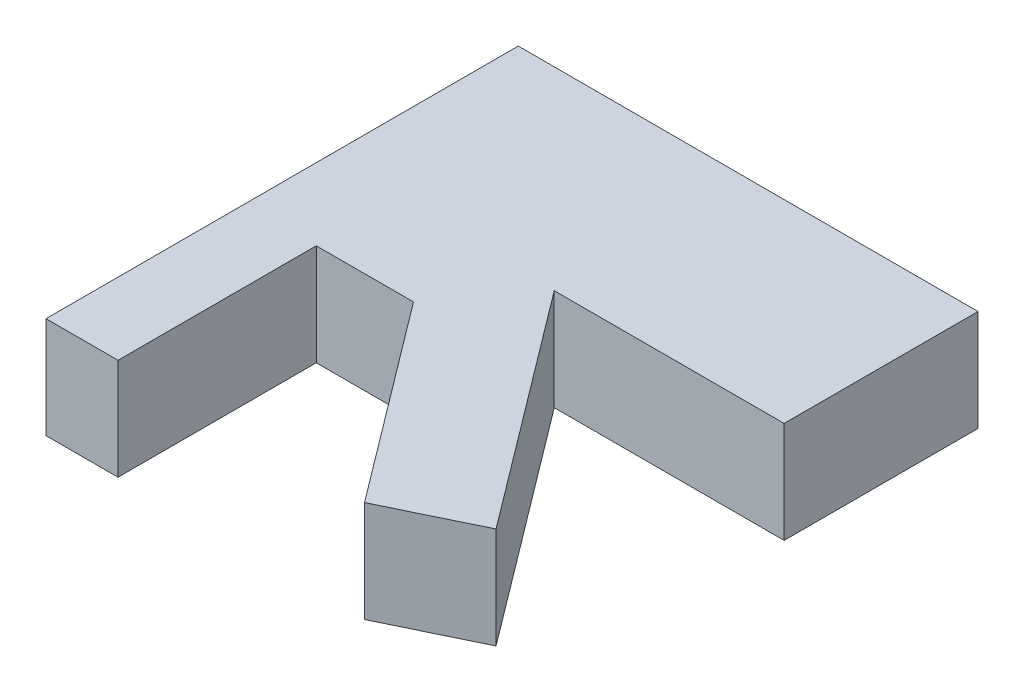
ISO-10303-21;
HEADER;
FILE_DESCRIPTION(('STEP AP214'),'2;1');
FILE_NAME('part.step','',(''),(''),'','','');
FILE_SCHEMA(('AUTOMOTIVE_DESIGN { 1 0 10303 214 1 1 1 1 }'));
ENDSEC;
DATA;
#1=APPLICATION_CONTEXT('core data for automotive mechanical design processes');
#2=APPLICATION_PROTOCOL_DEFINITION('international standard','automotive_design',2000,#1);
#3=PRODUCT_CONTEXT('',#1,'mechanical');
#4=PRODUCT('Part','Part','',(#3));
#5=PRODUCT_RELATED_PRODUCT_CATEGORY('part','',(#4));
#6=PRODUCT_DEFINITION_FORMATION('','',#4);
#7=PRODUCT_DEFINITION_CONTEXT('part definition',#1,'design');
#8=PRODUCT_DEFINITION('design','',#6,#7);
#9=PRODUCT_DEFINITION_SHAPE('','',#8);
#10=(LENGTH_UNIT() NAMED_UNIT(*) SI_UNIT(.MILLI.,.METRE.));
#11=(NAMED_UNIT(*) PLANE_ANGLE_UNIT() SI_UNIT($,.RADIAN.));
#12=(NAMED_UNIT(*) SI_UNIT($,.STERADIAN.) SOLID_ANGLE_UNIT());
#13=UNCERTAINTY_MEASURE_WITH_UNIT(LENGTH_MEASURE(1.E-05),#10,'distance_accuracy_value','');
#14=(GEOMETRIC_REPRESENTATION_CONTEXT(3) GLOBAL_UNCERTAINTY_ASSIGNED_CONTEXT((#13)) GLOBAL_UNIT_ASSIGNED_CONTEXT((#10,
#11,#12)) REPRESENTATION_CONTEXT('',''));
#15=CARTESIAN_POINT('',(0.,0.,0.));
#16=DIRECTION('',(0.,0.,1.));
#17=DIRECTION('',(1.,0.,0.));
#18=AXIS2_PLACEMENT_3D('',#15,#16,#17);
#19=CARTESIAN_POINT('',(7.10739238900271,10.,0.));
#20=DIRECTION('',(0.,0.,-1.));
#21=DIRECTION('',(-1.,0.,0.));
#22=AXIS2_PLACEMENT_3D('',#19,#20,#21);
#23=PLANE('',#22);
#24=DIRECTION('',(1.,0.,0.));
#25=VECTOR('',#24,1.);
#26=CARTESIAN_POINT('',(7.10739238900271,0.,0.));
#27=LINE('',#26,#25);
#28=CARTESIAN_POINT('',(0.,0.,0.));
#29=VERTEX_POINT('',#28);
#30=CARTESIAN_POINT('',(7.10739238900271,0.,0.));
#31=VERTEX_POINT('',#30);
#32=EDGE_CURVE('E141',#29,#31,#27,.T.);
#33=ORIENTED_EDGE('',*,*,#32,.T.);
#34=DIRECTION('',(0.,-1.,0.));
#35=VECTOR('',#34,1.);
#36=CARTESIAN_POINT('',(7.10739238900271,10.,0.));
#37=LINE('',#36,#35);
#38=CARTESIAN_POINT('',(7.10739238900271,10.,0.));
#39=VERTEX_POINT('',#38);
#40=EDGE_CURVE('E11',#39,#31,#37,.T.);
#41=ORIENTED_EDGE('',*,*,#40,.F.);
#42=DIRECTION('',(1.,0.,0.));
#43=VECTOR('',#42,1.);
#44=CARTESIAN_POINT('',(7.10739238900271,10.,0.));
#45=LINE('',#44,#43);
#46=CARTESIAN_POINT('',(0.,10.,0.));
#47=VERTEX_POINT('',#46);
#48=EDGE_CURVE('E159',#47,#39,#45,.T.);
#49=ORIENTED_EDGE('',*,*,#48,.F.);
#50=DIRECTION('',(0.,-1.,0.));
#51=VECTOR('',#50,1.);
#52=CARTESIAN_POINT('',(0.,10.,0.));
#53=LINE('',#52,#51);
#54=EDGE_CURVE('E137',#47,#29,#53,.T.);
#55=ORIENTED_EDGE('',*,*,#54,.T.);
#56=EDGE_LOOP('',(#33,#41,#49,#55));
#57=FACE_BOUND('',#56,.T.);
#58=ADVANCED_FACE('F33',(#57),#23,.F.);
#59=CARTESIAN_POINT('',(7.10739238900271,10.,-19.5669642323911));
#60=DIRECTION('',(-1.,0.,0.));
#61=DIRECTION('',(0.,0.,1.));
#62=AXIS2_PLACEMENT_3D('',#59,#60,#61);
#63=PLANE('',#62);
#64=DIRECTION('',(0.,0.,-1.));
#65=VECTOR('',#64,1.);
#66=CARTESIAN_POINT('',(7.10739238900271,0.,-19.5669642323911));
#67=LINE('',#66,#65);
#68=CARTESIAN_POINT('',(7.10739238900271,0.,-19.5669642323911));
#69=VERTEX_POINT('',#68);
#70=EDGE_CURVE('E144',#31,#69,#67,.T.);
#71=ORIENTED_EDGE('',*,*,#70,.T.);
#72=DIRECTION('',(0.,-1.,0.));
#73=VECTOR('',#72,1.);
#74=CARTESIAN_POINT('',(7.10739238900271,10.,-19.5669642323911));
#75=LINE('',#74,#73);
#76=CARTESIAN_POINT('',(7.10739238900271,10.,-19.5669642323911));
#77=VERTEX_POINT('',#76);
#78=EDGE_CURVE('E41',#77,#69,#75,.T.);
#79=ORIENTED_EDGE('',*,*,#78,.F.);
#80=DIRECTION('',(0.,0.,-1.));
#81=VECTOR('',#80,1.);
#82=CARTESIAN_POINT('',(7.10739238900271,10.,-19.5669642323911));
#83=LINE('',#82,#81);
#84=EDGE_CURVE('E98',#39,#77,#83,.T.);
#85=ORIENTED_EDGE('',*,*,#84,.F.);
#86=ORIENTED_EDGE('',*,*,#40,.T.);
#87=EDGE_LOOP('',(#71,#79,#85,#86));
#88=FACE_BOUND('',#87,.T.);
#89=ADVANCED_FACE('F208',(#88),#63,.F.);
#90=CARTESIAN_POINT('',(16.7037701899561,10.,-19.5669642323911));
#91=DIRECTION('',(0.,0.,-1.));
#92=DIRECTION('',(-1.,0.,0.));
#93=AXIS2_PLACEMENT_3D('',#90,#91,#92);
#94=PLANE('',#93);
#95=DIRECTION('',(1.,0.,0.));
#96=VECTOR('',#95,1.);
#97=CARTESIAN_POINT('',(16.7037701899561,0.,-19.5669642323911));
#98=LINE('',#97,#96);
#99=CARTESIAN_POINT('',(16.7037701899561,0.,-19.5669642323911));
#100=VERTEX_POINT('',#99);
#101=EDGE_CURVE('E146',#69,#100,#98,.T.);
#102=ORIENTED_EDGE('',*,*,#101,.T.);
#103=DIRECTION('',(0.,-1.,0.));
#104=VECTOR('',#103,1.);
#105=CARTESIAN_POINT('',(16.7037701899561,10.,-19.5669642323911));
#106=LINE('',#105,#104);
#107=CARTESIAN_POINT('',(16.7037701899561,10.,-19.5669642323911));
#108=VERTEX_POINT('',#107);
#109=EDGE_CURVE('E172',#108,#100,#106,.T.);
#110=ORIENTED_EDGE('',*,*,#109,.F.);
#111=DIRECTION('',(1.,0.,0.));
#112=VECTOR('',#111,1.);
#113=CARTESIAN_POINT('',(16.7037701899561,10.,-19.5669642323911));
#114=LINE('',#113,#112);
#115=EDGE_CURVE('E180',#77,#108,#114,.T.);
#116=ORIENTED_EDGE('',*,*,#115,.F.);
#117=ORIENTED_EDGE('',*,*,#78,.T.);
#118=EDGE_LOOP('',(#102,#110,#116,#117));
#119=FACE_BOUND('',#118,.T.);
#120=ADVANCED_FACE('F178',(#119),#94,.F.);
#121=CARTESIAN_POINT('',(31.4365432590505,10.,0.));
#122=DIRECTION('',(0.798870769139608,0.,-0.601502696763939));
#123=DIRECTION('',(-0.601502696763939,0.,-0.798870769139608));
#124=AXIS2_PLACEMENT_3D('',#121,#122,#123);
#125=PLANE('',#124);
#126=DIRECTION('',(0.601502696763939,0.,0.798870769139608));
#127=VECTOR('',#126,1.);
#128=CARTESIAN_POINT('',(31.4365432590505,0.,0.));
#129=LINE('',#128,#127);
#130=CARTESIAN_POINT('',(31.4365432590505,0.,0.));
#131=VERTEX_POINT('',#130);
#132=EDGE_CURVE('E148',#100,#131,#129,.T.);
#133=ORIENTED_EDGE('',*,*,#132,.T.);
#134=DIRECTION('',(0.,-1.,0.));
#135=VECTOR('',#134,1.);
#136=CARTESIAN_POINT('',(31.4365432590505,10.,0.));
#137=LINE('',#136,#135);
#138=CARTESIAN_POINT('',(31.4365432590505,10.,0.));
#139=VERTEX_POINT('',#138);
#140=EDGE_CURVE('E169',#139,#131,#137,.T.);
#141=ORIENTED_EDGE('',*,*,#140,.F.);
#142=DIRECTION('',(0.601502696763939,0.,0.798870769139608));
#143=VECTOR('',#142,1.);
#144=CARTESIAN_POINT('',(31.4365432590505,10.,0.));
#145=LINE('',#144,#143);
#146=EDGE_CURVE('E198',#108,#139,#145,.T.);
#147=ORIENTED_EDGE('',*,*,#146,.F.);
#148=ORIENTED_EDGE('',*,*,#109,.T.);
#149=EDGE_LOOP('',(#133,#141,#147,#148));
#150=FACE_BOUND('',#149,.T.);
#151=ADVANCED_FACE('F189',(#150),#125,.F.);
#152=CARTESIAN_POINT('',(40.1841031224384,10.,-4.23709930882854));
#153=DIRECTION('',(-0.435928453727026,0.,-0.899981323823536));
#154=DIRECTION('',(-0.899981323823536,0.,0.435928453727026));
#155=AXIS2_PLACEMENT_3D('',#152,#153,#154);
#156=PLANE('',#155);
#157=DIRECTION('',(0.899981323823536,0.,-0.435928453727026));
#158=VECTOR('',#157,1.);
#159=CARTESIAN_POINT('',(40.1841031224384,0.,-4.23709930882854));
#160=LINE('',#159,#158);
#161=CARTESIAN_POINT('',(40.1841031224384,0.,-4.23709930882854));
#162=VERTEX_POINT('',#161);
#163=EDGE_CURVE('E150',#131,#162,#160,.T.);
#164=ORIENTED_EDGE('',*,*,#163,.T.);
#165=DIRECTION('',(0.,-1.,0.));
#166=VECTOR('',#165,1.);
#167=CARTESIAN_POINT('',(40.1841031224384,10.,-4.23709930882854));
#168=LINE('',#167,#166);
#169=CARTESIAN_POINT('',(40.1841031224384,10.,-4.23709930882854));
#170=VERTEX_POINT('',#169);
#171=EDGE_CURVE('E166',#170,#162,#168,.T.);
#172=ORIENTED_EDGE('',*,*,#171,.F.);
#173=DIRECTION('',(0.899981323823536,0.,-0.435928453727026));
#174=VECTOR('',#173,1.);
#175=CARTESIAN_POINT('',(40.1841031224384,10.,-4.23709930882854));
#176=LINE('',#175,#174);
#177=EDGE_CURVE('E195',#139,#170,#176,.T.);
#178=ORIENTED_EDGE('',*,*,#177,.F.);
#179=ORIENTED_EDGE('',*,*,#140,.T.);
#180=EDGE_LOOP('',(#164,#172,#178,#179));
#181=FACE_BOUND('',#180,.T.);
#182=ADVANCED_FACE('F193',(#181),#156,.F.);
#183=CARTESIAN_POINT('',(22.6889833956625,10.,-27.4728051959528));
#184=DIRECTION('',(-0.798870769139608,0.,0.601502696763939));
#185=DIRECTION('',(0.601502696763939,0.,0.798870769139608));
#186=AXIS2_PLACEMENT_3D('',#183,#184,#185);
#187=PLANE('',#186);
#188=DIRECTION('',(-0.601502696763939,0.,-0.798870769139608));
#189=VECTOR('',#188,1.);
#190=CARTESIAN_POINT('',(22.6889833956625,0.,-27.4728051959528));
#191=LINE('',#190,#189);
#192=CARTESIAN_POINT('',(22.6889833956625,0.,-27.4728051959528));
#193=VERTEX_POINT('',#192);
#194=EDGE_CURVE('E152',#162,#193,#191,.T.);
#195=ORIENTED_EDGE('',*,*,#194,.T.);
#196=DIRECTION('',(0.,-1.,0.));
#197=VECTOR('',#196,1.);
#198=CARTESIAN_POINT('',(22.6889833956625,10.,-27.4728051959528));
#199=LINE('',#198,#197);
#200=CARTESIAN_POINT('',(22.6889833956625,10.,-27.4728051959528));
#201=VERTEX_POINT('',#200);
#202=EDGE_CURVE('E163',#201,#193,#199,.T.);
#203=ORIENTED_EDGE('',*,*,#202,.F.);
#204=DIRECTION('',(-0.601502696763939,0.,-0.798870769139608));
#205=VECTOR('',#204,1.);
#206=CARTESIAN_POINT('',(22.6889833956625,10.,-27.4728051959528));
#207=LINE('',#206,#205);
#208=EDGE_CURVE('E197',#170,#201,#207,.T.);
#209=ORIENTED_EDGE('',*,*,#208,.F.);
#210=ORIENTED_EDGE('',*,*,#171,.T.);
#211=EDGE_LOOP('',(#195,#203,#209,#210));
#212=FACE_BOUND('',#211,.T.);
#213=ADVANCED_FACE('F220',(#212),#187,.F.);
#214=CARTESIAN_POINT('',(45.3779667913251,10.,-27.4728051959528));
#215=DIRECTION('',(0.,0.,-1.));
#216=DIRECTION('',(-1.,0.,0.));
#217=AXIS2_PLACEMENT_3D('',#214,#215,#216);
#218=PLANE('',#217);
#219=DIRECTION('',(1.,0.,0.));
#220=VECTOR('',#219,1.);
#221=CARTESIAN_POINT('',(45.3779667913251,0.,-27.4728051959528));
#222=LINE('',#221,#220);
#223=CARTESIAN_POINT('',(45.3779667913251,0.,-27.4728051959528));
#224=VERTEX_POINT('',#223);
#225=EDGE_CURVE('E154',#193,#224,#222,.T.);
#226=ORIENTED_EDGE('',*,*,#225,.T.);
#227=DIRECTION('',(0.,-1.,0.));
#228=VECTOR('',#227,1.);
#229=CARTESIAN_POINT('',(45.3779667913251,10.,-27.4728051959528));
#230=LINE('',#229,#228);
#231=CARTESIAN_POINT('',(45.3779667913251,10.,-27.4728051959528));
#232=VERTEX_POINT('',#231);
#233=EDGE_CURVE('E132',#232,#224,#230,.T.);
#234=ORIENTED_EDGE('',*,*,#233,.F.);
#235=DIRECTION('',(1.,0.,0.));
#236=VECTOR('',#235,1.);
#237=CARTESIAN_POINT('',(45.3779667913251,10.,-27.4728051959528));
#238=LINE('',#237,#236);
#239=EDGE_CURVE('E123',#201,#232,#238,.T.);
#240=ORIENTED_EDGE('',*,*,#239,.F.);
#241=ORIENTED_EDGE('',*,*,#202,.T.);
#242=EDGE_LOOP('',(#226,#234,#240,#241));
#243=FACE_BOUND('',#242,.T.);
#244=ADVANCED_FACE('F223',(#243),#218,.F.);
#245=CARTESIAN_POINT('',(45.3779667913251,10.,-46.608092397114));
#246=DIRECTION('',(-1.,0.,0.));
#247=DIRECTION('',(0.,0.,1.));
#248=AXIS2_PLACEMENT_3D('',#245,#246,#247);
#249=PLANE('',#248);
#250=DIRECTION('',(0.,0.,-1.));
#251=VECTOR('',#250,1.);
#252=CARTESIAN_POINT('',(45.3779667913251,0.,-46.608092397114));
#253=LINE('',#252,#251);
#254=CARTESIAN_POINT('',(45.3779667913251,0.,-46.608092397114));
#255=VERTEX_POINT('',#254);
#256=EDGE_CURVE('E131',#224,#255,#253,.T.);
#257=ORIENTED_EDGE('',*,*,#256,.T.);
#258=DIRECTION('',(0.,-1.,0.));
#259=VECTOR('',#258,1.);
#260=CARTESIAN_POINT('',(45.3779667913251,10.,-46.608092397114));
#261=LINE('',#260,#259);
#262=CARTESIAN_POINT('',(45.3779667913251,10.,-46.608092397114));
#263=VERTEX_POINT('',#262);
#264=EDGE_CURVE('E128',#263,#255,#261,.T.);
#265=ORIENTED_EDGE('',*,*,#264,.F.);
#266=DIRECTION('',(0.,0.,-1.));
#267=VECTOR('',#266,1.);
#268=CARTESIAN_POINT('',(45.3779667913251,10.,-46.608092397114));
#269=LINE('',#268,#267);
#270=EDGE_CURVE('E117',#232,#263,#269,.T.);
#271=ORIENTED_EDGE('',*,*,#270,.F.);
#272=ORIENTED_EDGE('',*,*,#233,.T.);
#273=EDGE_LOOP('',(#257,#265,#271,#272));
#274=FACE_BOUND('',#273,.T.);
#275=ADVANCED_FACE('F129',(#274),#249,.F.);
#276=CARTESIAN_POINT('',(0.,10.,-46.608092397114));
#277=DIRECTION('',(0.,0.,1.));
#278=DIRECTION('',(1.,0.,0.));
#279=AXIS2_PLACEMENT_3D('',#276,#277,#278);
#280=PLANE('',#279);
#281=DIRECTION('',(-1.,0.,0.));
#282=VECTOR('',#281,1.);
#283=CARTESIAN_POINT('',(0.,0.,-46.608092397114));
#284=LINE('',#283,#282);
#285=CARTESIAN_POINT('',(0.,0.,-46.608092397114));
#286=VERTEX_POINT('',#285);
#287=EDGE_CURVE('E84',#255,#286,#284,.T.);
#288=ORIENTED_EDGE('',*,*,#287,.T.);
#289=DIRECTION('',(0.,-1.,0.));
#290=VECTOR('',#289,1.);
#291=CARTESIAN_POINT('',(0.,10.,-46.608092397114));
#292=LINE('',#291,#290);
#293=CARTESIAN_POINT('',(0.,10.,-46.608092397114));
#294=VERTEX_POINT('',#293);
#295=EDGE_CURVE('E133',#294,#286,#292,.T.);
#296=ORIENTED_EDGE('',*,*,#295,.F.);
#297=DIRECTION('',(-1.,0.,0.));
#298=VECTOR('',#297,1.);
#299=CARTESIAN_POINT('',(0.,10.,-46.608092397114));
#300=LINE('',#299,#298);
#301=EDGE_CURVE('E121',#263,#294,#300,.T.);
#302=ORIENTED_EDGE('',*,*,#301,.F.);
#303=ORIENTED_EDGE('',*,*,#264,.T.);
#304=EDGE_LOOP('',(#288,#296,#302,#303));
#305=FACE_BOUND('',#304,.T.);
#306=ADVANCED_FACE('F135',(#305),#280,.F.);
#307=CARTESIAN_POINT('',(0.,10.,0.));
#308=DIRECTION('',(1.,0.,0.));
#309=DIRECTION('',(0.,0.,-1.));
#310=AXIS2_PLACEMENT_3D('',#307,#308,#309);
#311=PLANE('',#310);
#312=DIRECTION('',(0.,0.,1.));
#313=VECTOR('',#312,1.);
#314=CARTESIAN_POINT('',(0.,0.,0.));
#315=LINE('',#314,#313);
#316=EDGE_CURVE('E90',#286,#29,#315,.T.);
#317=ORIENTED_EDGE('',*,*,#316,.T.);
#318=ORIENTED_EDGE('',*,*,#54,.F.);
#319=DIRECTION('',(0.,0.,1.));
#320=VECTOR('',#319,1.);
#321=CARTESIAN_POINT('',(0.,10.,0.));
#322=LINE('',#321,#320);
#323=EDGE_CURVE('E49',#294,#47,#322,.T.);
#324=ORIENTED_EDGE('',*,*,#323,.F.);
#325=ORIENTED_EDGE('',*,*,#295,.T.);
#326=EDGE_LOOP('',(#317,#318,#324,#325));
#327=FACE_BOUND('',#326,.T.);
#328=ADVANCED_FACE('F232',(#327),#311,.F.);
#329=CARTESIAN_POINT('',(0.,10.,0.));
#330=DIRECTION('',(0.,-1.,0.));
#331=DIRECTION('',(0.,0.,-1.));
#332=AXIS2_PLACEMENT_3D('',#329,#330,#331);
#333=PLANE('',#332);
#334=ORIENTED_EDGE('',*,*,#48,.T.);
#335=ORIENTED_EDGE('',*,*,#84,.T.);
#336=ORIENTED_EDGE('',*,*,#115,.T.);
#337=ORIENTED_EDGE('',*,*,#146,.T.);
#338=ORIENTED_EDGE('',*,*,#177,.T.);
#339=ORIENTED_EDGE('',*,*,#208,.T.);
#340=ORIENTED_EDGE('',*,*,#239,.T.);
#341=ORIENTED_EDGE('',*,*,#270,.T.);
#342=ORIENTED_EDGE('',*,*,#301,.T.);
#343=ORIENTED_EDGE('',*,*,#323,.T.);
#344=EDGE_LOOP('',(#334,#335,#336,#337,#338,#339,#340,#341,#342,#343));
#345=FACE_BOUND('',#344,.T.);
#346=ADVANCED_FACE('F119',(#345),#333,.F.);
#347=CARTESIAN_POINT('',(0.,0.,0.));
#348=DIRECTION('',(0.,-1.,0.));
#349=DIRECTION('',(0.,0.,-1.));
#350=AXIS2_PLACEMENT_3D('',#347,#348,#349);
#351=PLANE('',#350);
#352=ORIENTED_EDGE('',*,*,#32,.F.);
#353=ORIENTED_EDGE('',*,*,#316,.F.);
#354=ORIENTED_EDGE('',*,*,#287,.F.);
#355=ORIENTED_EDGE('',*,*,#256,.F.);
#356=ORIENTED_EDGE('',*,*,#225,.F.);
#357=ORIENTED_EDGE('',*,*,#194,.F.);
#358=ORIENTED_EDGE('',*,*,#163,.F.);
#359=ORIENTED_EDGE('',*,*,#132,.F.);
#360=ORIENTED_EDGE('',*,*,#101,.F.);
#361=ORIENTED_EDGE('',*,*,#70,.F.);
#362=EDGE_LOOP('',(#352,#353,#354,#355,#356,#357,#358,#359,#360,#361));
#363=FACE_BOUND('',#362,.T.);
#364=ADVANCED_FACE('F184',(#363),#351,.T.);
#365=CLOSED_SHELL('',(#58,#89,#120,#151,#182,#213,#244,#275,#306,#328,#346,#364));
#366=MANIFOLD_SOLID_BREP('B2',#365);
#367=ADVANCED_BREP_SHAPE_REPRESENTATION('',(#18,#366),#14);
#368=SHAPE_DEFINITION_REPRESENTATION(#9,#367);
ENDSEC;
END-ISO-10303-21;
